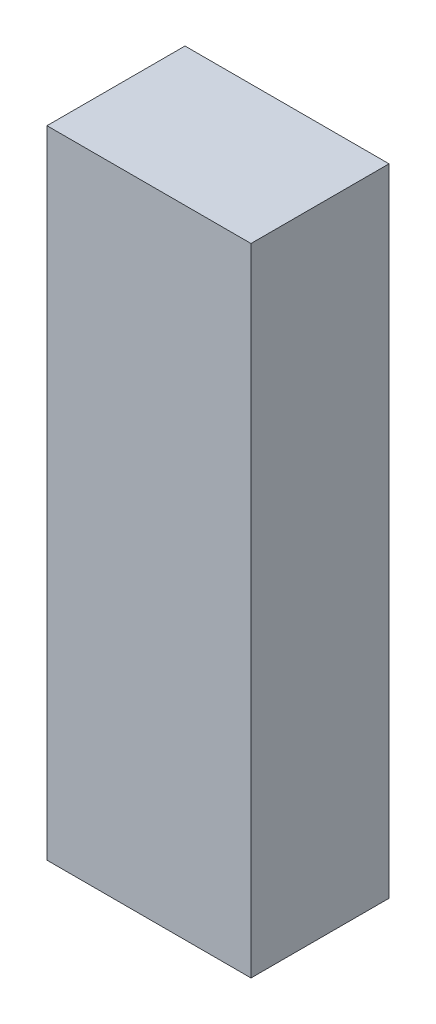
ISO-10303-21;
HEADER;
FILE_DESCRIPTION(('STEP AP214'),'2;1');
FILE_NAME('part.step','',(''),(''),'','','');
FILE_SCHEMA(('AUTOMOTIVE_DESIGN { 1 0 10303 214 1 1 1 1 }'));
ENDSEC;
DATA;
#1=APPLICATION_CONTEXT('core data for automotive mechanical design processes');
#2=APPLICATION_PROTOCOL_DEFINITION('international standard','automotive_design',2000,#1);
#3=PRODUCT_CONTEXT('',#1,'mechanical');
#4=PRODUCT('Part','Part','',(#3));
#5=PRODUCT_RELATED_PRODUCT_CATEGORY('part','',(#4));
#6=PRODUCT_DEFINITION_FORMATION('','',#4);
#7=PRODUCT_DEFINITION_CONTEXT('part definition',#1,'design');
#8=PRODUCT_DEFINITION('design','',#6,#7);
#9=PRODUCT_DEFINITION_SHAPE('','',#8);
#10=(LENGTH_UNIT() NAMED_UNIT(*) SI_UNIT(.MILLI.,.METRE.));
#11=(NAMED_UNIT(*) PLANE_ANGLE_UNIT() SI_UNIT($,.RADIAN.));
#12=(NAMED_UNIT(*) SI_UNIT($,.STERADIAN.) SOLID_ANGLE_UNIT());
#13=UNCERTAINTY_MEASURE_WITH_UNIT(LENGTH_MEASURE(1.E-05),#10,'distance_accuracy_value','');
#14=(GEOMETRIC_REPRESENTATION_CONTEXT(3) GLOBAL_UNCERTAINTY_ASSIGNED_CONTEXT((#13)) GLOBAL_UNIT_ASSIGNED_CONTEXT((#10,
#11,#12)) REPRESENTATION_CONTEXT('',''));
#15=CARTESIAN_POINT('',(0.,0.,0.));
#16=DIRECTION('',(0.,0.,1.));
#17=DIRECTION('',(1.,0.,0.));
#18=AXIS2_PLACEMENT_3D('',#15,#16,#17);
#19=CARTESIAN_POINT('',(34.,0.,23.));
#20=DIRECTION('',(0.,1.,0.));
#21=DIRECTION('',(0.,0.,1.));
#22=AXIS2_PLACEMENT_3D('',#19,#20,#21);
#23=PLANE('',#22);
#24=DIRECTION('',(1.,0.,0.));
#25=VECTOR('',#24,1.);
#26=CARTESIAN_POINT('',(34.,0.,0.));
#27=LINE('',#26,#25);
#28=CARTESIAN_POINT('',(0.,0.,0.));
#29=VERTEX_POINT('',#28);
#30=CARTESIAN_POINT('',(34.,0.,0.));
#31=VERTEX_POINT('',#30);
#32=EDGE_CURVE('E96',#29,#31,#27,.T.);
#33=ORIENTED_EDGE('',*,*,#32,.T.);
#34=DIRECTION('',(0.,0.,-1.));
#35=VECTOR('',#34,1.);
#36=CARTESIAN_POINT('',(34.,0.,23.));
#37=LINE('',#36,#35);
#38=CARTESIAN_POINT('',(34.,0.,23.));
#39=VERTEX_POINT('',#38);
#40=EDGE_CURVE('E11',#39,#31,#37,.T.);
#41=ORIENTED_EDGE('',*,*,#40,.F.);
#42=DIRECTION('',(1.,0.,0.));
#43=VECTOR('',#42,1.);
#44=CARTESIAN_POINT('',(34.,0.,23.));
#45=LINE('',#44,#43);
#46=CARTESIAN_POINT('',(0.,0.,23.));
#47=VERTEX_POINT('',#46);
#48=EDGE_CURVE('E84',#47,#39,#45,.T.);
#49=ORIENTED_EDGE('',*,*,#48,.F.);
#50=DIRECTION('',(0.,0.,-1.));
#51=VECTOR('',#50,1.);
#52=CARTESIAN_POINT('',(0.,0.,23.));
#53=LINE('',#52,#51);
#54=EDGE_CURVE('E92',#47,#29,#53,.T.);
#55=ORIENTED_EDGE('',*,*,#54,.T.);
#56=EDGE_LOOP('',(#33,#41,#49,#55));
#57=FACE_BOUND('',#56,.T.);
#58=ADVANCED_FACE('F33',(#57),#23,.F.);
#59=CARTESIAN_POINT('',(34.,106.,23.));
#60=DIRECTION('',(-1.,0.,0.));
#61=DIRECTION('',(0.,0.,1.));
#62=AXIS2_PLACEMENT_3D('',#59,#60,#61);
#63=PLANE('',#62);
#64=DIRECTION('',(0.,1.,0.));
#65=VECTOR('',#64,1.);
#66=CARTESIAN_POINT('',(34.,106.,0.));
#67=LINE('',#66,#65);
#68=CARTESIAN_POINT('',(34.,106.,0.));
#69=VERTEX_POINT('',#68);
#70=EDGE_CURVE('E88',#31,#69,#67,.T.);
#71=ORIENTED_EDGE('',*,*,#70,.T.);
#72=DIRECTION('',(0.,0.,-1.));
#73=VECTOR('',#72,1.);
#74=CARTESIAN_POINT('',(34.,106.,23.));
#75=LINE('',#74,#73);
#76=CARTESIAN_POINT('',(34.,106.,23.));
#77=VERTEX_POINT('',#76);
#78=EDGE_CURVE('E41',#77,#69,#75,.T.);
#79=ORIENTED_EDGE('',*,*,#78,.F.);
#80=DIRECTION('',(0.,1.,0.));
#81=VECTOR('',#80,1.);
#82=CARTESIAN_POINT('',(34.,106.,23.));
#83=LINE('',#82,#81);
#84=EDGE_CURVE('E79',#39,#77,#83,.T.);
#85=ORIENTED_EDGE('',*,*,#84,.F.);
#86=ORIENTED_EDGE('',*,*,#40,.T.);
#87=EDGE_LOOP('',(#71,#79,#85,#86));
#88=FACE_BOUND('',#87,.T.);
#89=ADVANCED_FACE('F87',(#88),#63,.F.);
#90=CARTESIAN_POINT('',(0.,106.,23.));
#91=DIRECTION('',(0.,-1.,0.));
#92=DIRECTION('',(0.,0.,-1.));
#93=AXIS2_PLACEMENT_3D('',#90,#91,#92);
#94=PLANE('',#93);
#95=DIRECTION('',(-1.,0.,0.));
#96=VECTOR('',#95,1.);
#97=CARTESIAN_POINT('',(0.,106.,0.));
#98=LINE('',#97,#96);
#99=CARTESIAN_POINT('',(0.,106.,0.));
#100=VERTEX_POINT('',#99);
#101=EDGE_CURVE('E66',#69,#100,#98,.T.);
#102=ORIENTED_EDGE('',*,*,#101,.T.);
#103=DIRECTION('',(0.,0.,-1.));
#104=VECTOR('',#103,1.);
#105=CARTESIAN_POINT('',(0.,106.,23.));
#106=LINE('',#105,#104);
#107=CARTESIAN_POINT('',(0.,106.,23.));
#108=VERTEX_POINT('',#107);
#109=EDGE_CURVE('E89',#108,#100,#106,.T.);
#110=ORIENTED_EDGE('',*,*,#109,.F.);
#111=DIRECTION('',(-1.,0.,0.));
#112=VECTOR('',#111,1.);
#113=CARTESIAN_POINT('',(0.,106.,23.));
#114=LINE('',#113,#112);
#115=EDGE_CURVE('E82',#77,#108,#114,.T.);
#116=ORIENTED_EDGE('',*,*,#115,.F.);
#117=ORIENTED_EDGE('',*,*,#78,.T.);
#118=EDGE_LOOP('',(#102,#110,#116,#117));
#119=FACE_BOUND('',#118,.T.);
#120=ADVANCED_FACE('F90',(#119),#94,.F.);
#121=CARTESIAN_POINT('',(0.,0.,23.));
#122=DIRECTION('',(1.,0.,0.));
#123=DIRECTION('',(0.,0.,-1.));
#124=AXIS2_PLACEMENT_3D('',#121,#122,#123);
#125=PLANE('',#124);
#126=DIRECTION('',(0.,-1.,0.));
#127=VECTOR('',#126,1.);
#128=CARTESIAN_POINT('',(0.,0.,0.));
#129=LINE('',#128,#127);
#130=EDGE_CURVE('E72',#100,#29,#129,.T.);
#131=ORIENTED_EDGE('',*,*,#130,.T.);
#132=ORIENTED_EDGE('',*,*,#54,.F.);
#133=DIRECTION('',(0.,-1.,0.));
#134=VECTOR('',#133,1.);
#135=CARTESIAN_POINT('',(0.,0.,23.));
#136=LINE('',#135,#134);
#137=EDGE_CURVE('E49',#108,#47,#136,.T.);
#138=ORIENTED_EDGE('',*,*,#137,.F.);
#139=ORIENTED_EDGE('',*,*,#109,.T.);
#140=EDGE_LOOP('',(#131,#132,#138,#139));
#141=FACE_BOUND('',#140,.T.);
#142=ADVANCED_FACE('F103',(#141),#125,.F.);
#143=CARTESIAN_POINT('',(0.,0.,23.));
#144=DIRECTION('',(0.,0.,-1.));
#145=DIRECTION('',(-1.,0.,0.));
#146=AXIS2_PLACEMENT_3D('',#143,#144,#145);
#147=PLANE('',#146);
#148=ORIENTED_EDGE('',*,*,#48,.T.);
#149=ORIENTED_EDGE('',*,*,#84,.T.);
#150=ORIENTED_EDGE('',*,*,#115,.T.);
#151=ORIENTED_EDGE('',*,*,#137,.T.);
#152=EDGE_LOOP('',(#148,#149,#150,#151));
#153=FACE_BOUND('',#152,.T.);
#154=ADVANCED_FACE('F80',(#153),#147,.F.);
#155=CARTESIAN_POINT('',(0.,0.,0.));
#156=DIRECTION('',(0.,0.,-1.));
#157=DIRECTION('',(-1.,0.,0.));
#158=AXIS2_PLACEMENT_3D('',#155,#156,#157);
#159=PLANE('',#158);
#160=ORIENTED_EDGE('',*,*,#32,.F.);
#161=ORIENTED_EDGE('',*,*,#130,.F.);
#162=ORIENTED_EDGE('',*,*,#101,.F.);
#163=ORIENTED_EDGE('',*,*,#70,.F.);
#164=EDGE_LOOP('',(#160,#161,#162,#163));
#165=FACE_BOUND('',#164,.T.);
#166=ADVANCED_FACE('F106',(#165),#159,.T.);
#167=CLOSED_SHELL('',(#58,#89,#120,#142,#154,#166));
#168=MANIFOLD_SOLID_BREP('B2',#167);
#169=ADVANCED_BREP_SHAPE_REPRESENTATION('',(#18,#168),#14);
#170=SHAPE_DEFINITION_REPRESENTATION(#9,#169);
ENDSEC;
END-ISO-10303-21;
